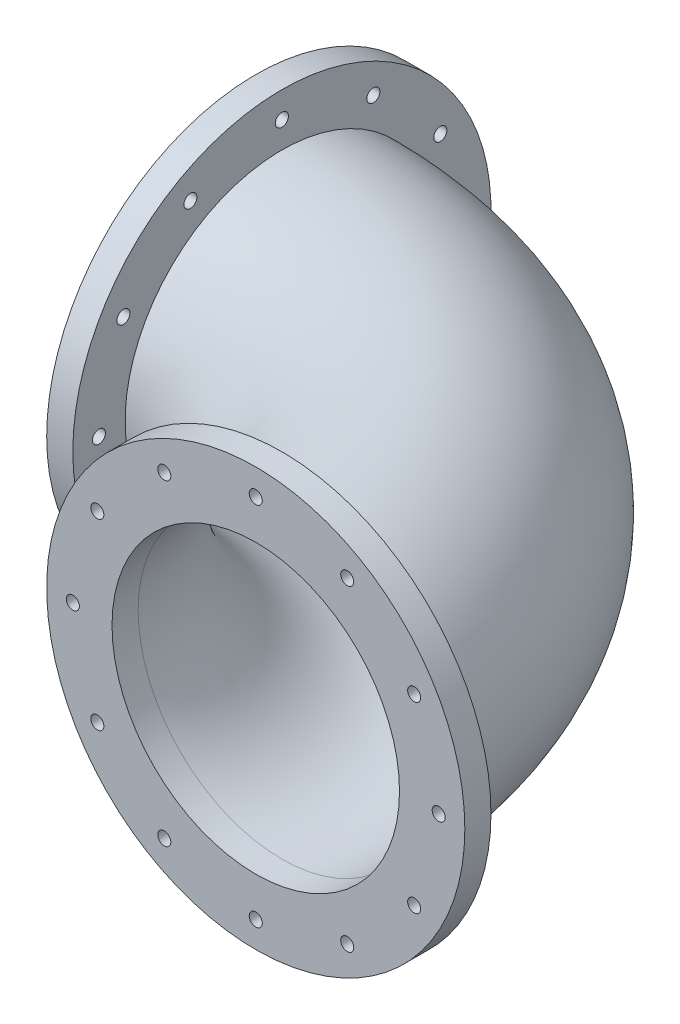
ISO-10303-21;
HEADER;
FILE_DESCRIPTION(('STEP AP214'),'2;1');
FILE_NAME('part.step','',(''),(''),'','','');
FILE_SCHEMA(('AUTOMOTIVE_DESIGN { 1 0 10303 214 1 1 1 1 }'));
ENDSEC;
DATA;
#1=APPLICATION_CONTEXT('core data for automotive mechanical design processes');
#2=APPLICATION_PROTOCOL_DEFINITION('international standard','automotive_design',2000,#1);
#3=PRODUCT_CONTEXT('',#1,'mechanical');
#4=PRODUCT('Part','Part','',(#3));
#5=PRODUCT_RELATED_PRODUCT_CATEGORY('part','',(#4));
#6=PRODUCT_DEFINITION_FORMATION('','',#4);
#7=PRODUCT_DEFINITION_CONTEXT('part definition',#1,'design');
#8=PRODUCT_DEFINITION('design','',#6,#7);
#9=PRODUCT_DEFINITION_SHAPE('','',#8);
#10=(LENGTH_UNIT() NAMED_UNIT(*) SI_UNIT(.MILLI.,.METRE.));
#11=(NAMED_UNIT(*) PLANE_ANGLE_UNIT() SI_UNIT($,.RADIAN.));
#12=(NAMED_UNIT(*) SI_UNIT($,.STERADIAN.) SOLID_ANGLE_UNIT());
#13=UNCERTAINTY_MEASURE_WITH_UNIT(LENGTH_MEASURE(1.E-05),#10,'distance_accuracy_value','');
#14=(GEOMETRIC_REPRESENTATION_CONTEXT(3) GLOBAL_UNCERTAINTY_ASSIGNED_CONTEXT((#13)) GLOBAL_UNIT_ASSIGNED_CONTEXT((#10,
#11,#12)) REPRESENTATION_CONTEXT('',''));
#15=CARTESIAN_POINT('',(0.,0.,0.));
#16=DIRECTION('',(0.,0.,1.));
#17=DIRECTION('',(1.,0.,0.));
#18=AXIS2_PLACEMENT_3D('',#15,#16,#17);
#19=CARTESIAN_POINT('',(0.,0.,0.));
#20=DIRECTION('',(0.,-1.,0.));
#21=DIRECTION('',(0.,0.,-1.));
#22=AXIS2_PLACEMENT_3D('',#19,#20,#21);
#23=TOROIDAL_SURFACE('',#22,152.4,76.2);
#24=CARTESIAN_POINT('',(0.,0.,-152.4));
#25=DIRECTION('',(1.,0.,0.));
#26=DIRECTION('',(0.,0.,-1.));
#27=AXIS2_PLACEMENT_3D('',#24,#25,#26);
#28=CIRCLE('',#27,76.2);
#29=CARTESIAN_POINT('',(0.,0.,-228.6));
#30=VERTEX_POINT('',#29);
#31=EDGE_CURVE('E203',#30,#30,#28,.T.);
#32=CARTESIAN_POINT('',(152.4,0.,0.));
#33=DIRECTION('',(0.,0.,1.));
#34=DIRECTION('',(1.,0.,0.));
#35=AXIS2_PLACEMENT_3D('',#32,#33,#34);
#36=CIRCLE('',#35,76.2);
#37=CARTESIAN_POINT('',(228.6,0.,0.));
#38=VERTEX_POINT('',#37);
#39=EDGE_CURVE('E208',#38,#38,#36,.T.);
#40=CARTESIAN_POINT('',(0.,0.,0.));
#41=DIRECTION('',(0.,-1.,0.));
#42=DIRECTION('',(0.,0.,-1.));
#43=AXIS2_PLACEMENT_3D('',#40,#41,#42);
#44=CIRCLE('',#43,228.6);
#45=EDGE_CURVE('',#30,#38,#44,.T.);
#46=ORIENTED_EDGE('',*,*,#31,.T.);
#47=ORIENTED_EDGE('',*,*,#39,.F.);
#48=ORIENTED_EDGE('',*,*,#45,.T.);
#49=ORIENTED_EDGE('',*,*,#45,.F.);
#50=EDGE_LOOP('',(#46,#48,#47,#49));
#51=FACE_BOUND('',#50,.T.);
#52=ADVANCED_FACE('F200',(#51),#23,.T.);
#53=CARTESIAN_POINT('',(0.,0.,0.));
#54=DIRECTION('',(0.,-1.,0.));
#55=DIRECTION('',(0.,0.,-1.));
#56=AXIS2_PLACEMENT_3D('',#53,#54,#55);
#57=TOROIDAL_SURFACE('',#56,152.4,69.85);
#58=CARTESIAN_POINT('',(0.,0.,-152.4));
#59=DIRECTION('',(-1.,0.,0.));
#60=DIRECTION('',(0.,0.,1.));
#61=AXIS2_PLACEMENT_3D('',#58,#59,#60);
#62=CIRCLE('',#61,69.85);
#63=CARTESIAN_POINT('',(0.,0.,-222.25));
#64=VERTEX_POINT('',#63);
#65=EDGE_CURVE('E225',#64,#64,#62,.T.);
#66=CARTESIAN_POINT('',(152.4,0.,0.));
#67=DIRECTION('',(0.,0.,1.));
#68=DIRECTION('',(1.,0.,0.));
#69=AXIS2_PLACEMENT_3D('',#66,#67,#68);
#70=CIRCLE('',#69,69.85);
#71=CARTESIAN_POINT('',(222.25,0.,0.));
#72=VERTEX_POINT('',#71);
#73=EDGE_CURVE('E11',#72,#72,#70,.F.);
#74=CARTESIAN_POINT('',(0.,0.,0.));
#75=DIRECTION('',(0.,-1.,0.));
#76=DIRECTION('',(0.,0.,-1.));
#77=AXIS2_PLACEMENT_3D('',#74,#75,#76);
#78=CIRCLE('',#77,222.25);
#79=EDGE_CURVE('',#64,#72,#78,.T.);
#80=ORIENTED_EDGE('',*,*,#65,.T.);
#81=ORIENTED_EDGE('',*,*,#73,.F.);
#82=ORIENTED_EDGE('',*,*,#79,.T.);
#83=ORIENTED_EDGE('',*,*,#79,.F.);
#84=EDGE_LOOP('',(#80,#82,#81,#83));
#85=FACE_BOUND('',#84,.T.);
#86=ADVANCED_FACE('F460',(#85),#57,.F.);
#87=CARTESIAN_POINT('',(-12.7,0.,-152.4));
#88=DIRECTION('',(-1.,0.,0.));
#89=DIRECTION('',(0.,0.,1.));
#90=AXIS2_PLACEMENT_3D('',#87,#88,#89);
#91=PLANE('',#90);
#92=CARTESIAN_POINT('',(-12.7,0.,-241.3));
#93=DIRECTION('',(-1.,0.,0.));
#94=DIRECTION('',(0.,0.,1.));
#95=AXIS2_PLACEMENT_3D('',#92,#93,#94);
#96=CIRCLE('',#95,3.175);
#97=CARTESIAN_POINT('',(-12.7,0.,-238.125));
#98=VERTEX_POINT('',#97);
#99=EDGE_CURVE('E309',#98,#98,#96,.T.);
#100=ORIENTED_EDGE('',*,*,#99,.F.);
#101=EDGE_LOOP('',(#100));
#102=FACE_BOUND('',#101,.T.);
#103=CARTESIAN_POINT('',(-12.7,76.9896583964361,-196.850000000001));
#104=DIRECTION('',(-1.,0.,0.));
#105=DIRECTION('',(0.,0.,1.));
#106=AXIS2_PLACEMENT_3D('',#103,#104,#105);
#107=CIRCLE('',#106,3.17500000000001);
#108=CARTESIAN_POINT('',(-12.7,76.9896583964361,-193.675000000001));
#109=VERTEX_POINT('',#108);
#110=EDGE_CURVE('E293',#109,#109,#107,.T.);
#111=ORIENTED_EDGE('',*,*,#110,.F.);
#112=EDGE_LOOP('',(#111));
#113=FACE_BOUND('',#112,.T.);
#114=CARTESIAN_POINT('',(-12.7,76.989658396437,-107.950000000001));
#115=DIRECTION('',(-1.,0.,0.));
#116=DIRECTION('',(0.,0.,1.));
#117=AXIS2_PLACEMENT_3D('',#114,#115,#116);
#118=CIRCLE('',#117,3.175);
#119=CARTESIAN_POINT('',(-12.7,76.989658396437,-104.775000000001));
#120=VERTEX_POINT('',#119);
#121=EDGE_CURVE('E277',#120,#120,#118,.T.);
#122=ORIENTED_EDGE('',*,*,#121,.F.);
#123=EDGE_LOOP('',(#122));
#124=FACE_BOUND('',#123,.T.);
#125=CARTESIAN_POINT('',(-12.7,6.20785382046309E-13,-63.5));
#126=DIRECTION('',(-1.,0.,0.));
#127=DIRECTION('',(0.,0.,1.));
#128=AXIS2_PLACEMENT_3D('',#125,#126,#127);
#129=CIRCLE('',#128,3.17500000000001);
#130=CARTESIAN_POINT('',(-12.7,6.20785382046309E-13,-60.325));
#131=VERTEX_POINT('',#130);
#132=EDGE_CURVE('E261',#131,#131,#129,.T.);
#133=ORIENTED_EDGE('',*,*,#132,.F.);
#134=EDGE_LOOP('',(#133));
#135=FACE_BOUND('',#134,.T.);
#136=CARTESIAN_POINT('',(-12.7,-76.9896583964364,-107.95));
#137=DIRECTION('',(-1.,0.,0.));
#138=DIRECTION('',(0.,0.,1.));
#139=AXIS2_PLACEMENT_3D('',#136,#137,#138);
#140=CIRCLE('',#139,3.17499999999998);
#141=CARTESIAN_POINT('',(-12.7,-76.9896583964364,-104.775));
#142=VERTEX_POINT('',#141);
#143=EDGE_CURVE('E245',#142,#142,#140,.T.);
#144=ORIENTED_EDGE('',*,*,#143,.F.);
#145=EDGE_LOOP('',(#144));
#146=FACE_BOUND('',#145,.T.);
#147=CARTESIAN_POINT('',(-12.7,-76.9896583964367,-196.85));
#148=DIRECTION('',(-1.,0.,0.));
#149=DIRECTION('',(0.,0.,1.));
#150=AXIS2_PLACEMENT_3D('',#147,#148,#149);
#151=CIRCLE('',#150,3.175);
#152=CARTESIAN_POINT('',(-12.7,-76.9896583964367,-193.675));
#153=VERTEX_POINT('',#152);
#154=EDGE_CURVE('E229',#153,#153,#151,.T.);
#155=ORIENTED_EDGE('',*,*,#154,.F.);
#156=EDGE_LOOP('',(#155));
#157=FACE_BOUND('',#156,.T.);
#158=CARTESIAN_POINT('',(-12.7,0.,-152.4));
#159=DIRECTION('',(-1.,0.,0.));
#160=DIRECTION('',(0.,0.,1.));
#161=AXIS2_PLACEMENT_3D('',#158,#159,#160);
#162=CIRCLE('',#161,101.6);
#163=CARTESIAN_POINT('',(-12.7,0.,-50.8));
#164=VERTEX_POINT('',#163);
#165=EDGE_CURVE('E220',#164,#164,#162,.T.);
#166=ORIENTED_EDGE('',*,*,#165,.T.);
#167=EDGE_LOOP('',(#166));
#168=FACE_BOUND('',#167,.T.);
#169=CARTESIAN_POINT('',(-12.7,0.,-152.4));
#170=DIRECTION('',(-1.,0.,0.));
#171=DIRECTION('',(0.,0.,1.));
#172=AXIS2_PLACEMENT_3D('',#169,#170,#171);
#173=CIRCLE('',#172,69.85);
#174=CARTESIAN_POINT('',(-12.7,0.,-82.55));
#175=VERTEX_POINT('',#174);
#176=EDGE_CURVE('E221',#175,#175,#173,.T.);
#177=ORIENTED_EDGE('',*,*,#176,.F.);
#178=EDGE_LOOP('',(#177));
#179=FACE_BOUND('',#178,.T.);
#180=CARTESIAN_POINT('',(-12.7,-88.9,-152.4));
#181=DIRECTION('',(-1.,0.,0.));
#182=DIRECTION('',(0.,0.,1.));
#183=AXIS2_PLACEMENT_3D('',#180,#181,#182);
#184=CIRCLE('',#183,3.175);
#185=CARTESIAN_POINT('',(-12.7,-88.9,-149.225));
#186=VERTEX_POINT('',#185);
#187=EDGE_CURVE('E237',#186,#186,#184,.T.);
#188=ORIENTED_EDGE('',*,*,#187,.F.);
#189=EDGE_LOOP('',(#188));
#190=FACE_BOUND('',#189,.T.);
#191=CARTESIAN_POINT('',(-12.7,-44.4499999999995,-75.4103416035631));
#192=DIRECTION('',(-1.,0.,0.));
#193=DIRECTION('',(0.,0.,1.));
#194=AXIS2_PLACEMENT_3D('',#191,#192,#193);
#195=CIRCLE('',#194,3.175);
#196=CARTESIAN_POINT('',(-12.7,-44.4499999999995,-72.2353416035631));
#197=VERTEX_POINT('',#196);
#198=EDGE_CURVE('E253',#197,#197,#195,.T.);
#199=ORIENTED_EDGE('',*,*,#198,.F.);
#200=EDGE_LOOP('',(#199));
#201=FACE_BOUND('',#200,.T.);
#202=CARTESIAN_POINT('',(-12.7,44.4500000000007,-75.4103416035638));
#203=DIRECTION('',(-1.,0.,0.));
#204=DIRECTION('',(0.,0.,1.));
#205=AXIS2_PLACEMENT_3D('',#202,#203,#204);
#206=CIRCLE('',#205,3.17500000000002);
#207=CARTESIAN_POINT('',(-12.7,44.4500000000007,-72.2353416035638));
#208=VERTEX_POINT('',#207);
#209=EDGE_CURVE('E269',#208,#208,#206,.T.);
#210=ORIENTED_EDGE('',*,*,#209,.F.);
#211=EDGE_LOOP('',(#210));
#212=FACE_BOUND('',#211,.T.);
#213=CARTESIAN_POINT('',(-12.7,88.9,-152.400000000001));
#214=DIRECTION('',(-1.,0.,0.));
#215=DIRECTION('',(0.,0.,1.));
#216=AXIS2_PLACEMENT_3D('',#213,#214,#215);
#217=CIRCLE('',#216,3.17500000000001);
#218=CARTESIAN_POINT('',(-12.7,88.9,-149.225000000001));
#219=VERTEX_POINT('',#218);
#220=EDGE_CURVE('E285',#219,#219,#217,.T.);
#221=ORIENTED_EDGE('',*,*,#220,.F.);
#222=EDGE_LOOP('',(#221));
#223=FACE_BOUND('',#222,.T.);
#224=CARTESIAN_POINT('',(-12.7,44.449999999999,-229.389658396437));
#225=DIRECTION('',(-1.,0.,0.));
#226=DIRECTION('',(0.,0.,1.));
#227=AXIS2_PLACEMENT_3D('',#224,#225,#226);
#228=CIRCLE('',#227,3.17500000000002);
#229=CARTESIAN_POINT('',(-12.7,44.449999999999,-226.214658396437));
#230=VERTEX_POINT('',#229);
#231=EDGE_CURVE('E301',#230,#230,#228,.T.);
#232=ORIENTED_EDGE('',*,*,#231,.F.);
#233=EDGE_LOOP('',(#232));
#234=FACE_BOUND('',#233,.T.);
#235=CARTESIAN_POINT('',(-12.7,-44.4500000000001,-229.389658396437));
#236=DIRECTION('',(-1.,0.,0.));
#237=DIRECTION('',(0.,0.,1.));
#238=AXIS2_PLACEMENT_3D('',#235,#236,#237);
#239=CIRCLE('',#238,3.175);
#240=CARTESIAN_POINT('',(-12.7,-44.4500000000001,-226.214658396437));
#241=VERTEX_POINT('',#240);
#242=EDGE_CURVE('E317',#241,#241,#239,.T.);
#243=ORIENTED_EDGE('',*,*,#242,.F.);
#244=EDGE_LOOP('',(#243));
#245=FACE_BOUND('',#244,.T.);
#246=ADVANCED_FACE('F462',(#102,#113,#124,#135,#146,#157,#168,#179,#190,#201,#212,#223,#234,
#245),#91,.T.);
#247=CARTESIAN_POINT('',(0.,0.,-152.4));
#248=DIRECTION('',(-1.,0.,0.));
#249=DIRECTION('',(0.,0.,1.));
#250=AXIS2_PLACEMENT_3D('',#247,#248,#249);
#251=PLANE('',#250);
#252=ORIENTED_EDGE('',*,*,#31,.F.);
#253=EDGE_LOOP('',(#252));
#254=FACE_BOUND('',#253,.T.);
#255=CARTESIAN_POINT('',(0.,0.,-152.4));
#256=DIRECTION('',(-1.,0.,0.));
#257=DIRECTION('',(0.,0.,1.));
#258=AXIS2_PLACEMENT_3D('',#255,#256,#257);
#259=CIRCLE('',#258,101.6);
#260=CARTESIAN_POINT('',(0.,0.,-50.8));
#261=VERTEX_POINT('',#260);
#262=EDGE_CURVE('E216',#261,#261,#259,.T.);
#263=ORIENTED_EDGE('',*,*,#262,.F.);
#264=EDGE_LOOP('',(#263));
#265=FACE_BOUND('',#264,.T.);
#266=CARTESIAN_POINT('',(0.,-76.9896583964367,-196.85));
#267=DIRECTION('',(-1.,0.,0.));
#268=DIRECTION('',(0.,0.,1.));
#269=AXIS2_PLACEMENT_3D('',#266,#267,#268);
#270=CIRCLE('',#269,3.175);
#271=CARTESIAN_POINT('',(0.,-76.9896583964367,-193.675));
#272=VERTEX_POINT('',#271);
#273=EDGE_CURVE('E233',#272,#272,#270,.T.);
#274=ORIENTED_EDGE('',*,*,#273,.T.);
#275=EDGE_LOOP('',(#274));
#276=FACE_BOUND('',#275,.T.);
#277=CARTESIAN_POINT('',(0.,-88.9,-152.4));
#278=DIRECTION('',(-1.,0.,0.));
#279=DIRECTION('',(0.,0.,1.));
#280=AXIS2_PLACEMENT_3D('',#277,#278,#279);
#281=CIRCLE('',#280,3.175);
#282=CARTESIAN_POINT('',(0.,-88.9,-149.225));
#283=VERTEX_POINT('',#282);
#284=EDGE_CURVE('E241',#283,#283,#281,.T.);
#285=ORIENTED_EDGE('',*,*,#284,.T.);
#286=EDGE_LOOP('',(#285));
#287=FACE_BOUND('',#286,.T.);
#288=CARTESIAN_POINT('',(0.,-76.9896583964364,-107.95));
#289=DIRECTION('',(-1.,0.,0.));
#290=DIRECTION('',(0.,0.,1.));
#291=AXIS2_PLACEMENT_3D('',#288,#289,#290);
#292=CIRCLE('',#291,3.17499999999998);
#293=CARTESIAN_POINT('',(0.,-76.9896583964364,-104.775));
#294=VERTEX_POINT('',#293);
#295=EDGE_CURVE('E249',#294,#294,#292,.T.);
#296=ORIENTED_EDGE('',*,*,#295,.T.);
#297=EDGE_LOOP('',(#296));
#298=FACE_BOUND('',#297,.T.);
#299=CARTESIAN_POINT('',(0.,-44.4499999999995,-75.4103416035631));
#300=DIRECTION('',(-1.,0.,0.));
#301=DIRECTION('',(0.,0.,1.));
#302=AXIS2_PLACEMENT_3D('',#299,#300,#301);
#303=CIRCLE('',#302,3.175);
#304=CARTESIAN_POINT('',(0.,-44.4499999999995,-72.2353416035631));
#305=VERTEX_POINT('',#304);
#306=EDGE_CURVE('E257',#305,#305,#303,.T.);
#307=ORIENTED_EDGE('',*,*,#306,.T.);
#308=EDGE_LOOP('',(#307));
#309=FACE_BOUND('',#308,.T.);
#310=CARTESIAN_POINT('',(0.,6.20785382046309E-13,-63.5));
#311=DIRECTION('',(-1.,0.,0.));
#312=DIRECTION('',(0.,0.,1.));
#313=AXIS2_PLACEMENT_3D('',#310,#311,#312);
#314=CIRCLE('',#313,3.17500000000001);
#315=CARTESIAN_POINT('',(0.,6.20785382046309E-13,-60.325));
#316=VERTEX_POINT('',#315);
#317=EDGE_CURVE('E265',#316,#316,#314,.T.);
#318=ORIENTED_EDGE('',*,*,#317,.T.);
#319=EDGE_LOOP('',(#318));
#320=FACE_BOUND('',#319,.T.);
#321=CARTESIAN_POINT('',(0.,44.4500000000007,-75.4103416035638));
#322=DIRECTION('',(-1.,0.,0.));
#323=DIRECTION('',(0.,0.,1.));
#324=AXIS2_PLACEMENT_3D('',#321,#322,#323);
#325=CIRCLE('',#324,3.17500000000002);
#326=CARTESIAN_POINT('',(0.,44.4500000000007,-72.2353416035638));
#327=VERTEX_POINT('',#326);
#328=EDGE_CURVE('E273',#327,#327,#325,.T.);
#329=ORIENTED_EDGE('',*,*,#328,.T.);
#330=EDGE_LOOP('',(#329));
#331=FACE_BOUND('',#330,.T.);
#332=CARTESIAN_POINT('',(0.,76.989658396437,-107.950000000001));
#333=DIRECTION('',(-1.,0.,0.));
#334=DIRECTION('',(0.,0.,1.));
#335=AXIS2_PLACEMENT_3D('',#332,#333,#334);
#336=CIRCLE('',#335,3.175);
#337=CARTESIAN_POINT('',(0.,76.989658396437,-104.775000000001));
#338=VERTEX_POINT('',#337);
#339=EDGE_CURVE('E281',#338,#338,#336,.T.);
#340=ORIENTED_EDGE('',*,*,#339,.T.);
#341=EDGE_LOOP('',(#340));
#342=FACE_BOUND('',#341,.T.);
#343=CARTESIAN_POINT('',(0.,88.9,-152.400000000001));
#344=DIRECTION('',(-1.,0.,0.));
#345=DIRECTION('',(0.,0.,1.));
#346=AXIS2_PLACEMENT_3D('',#343,#344,#345);
#347=CIRCLE('',#346,3.17500000000001);
#348=CARTESIAN_POINT('',(0.,88.9,-149.225000000001));
#349=VERTEX_POINT('',#348);
#350=EDGE_CURVE('E289',#349,#349,#347,.T.);
#351=ORIENTED_EDGE('',*,*,#350,.T.);
#352=EDGE_LOOP('',(#351));
#353=FACE_BOUND('',#352,.T.);
#354=CARTESIAN_POINT('',(0.,76.9896583964361,-196.850000000001));
#355=DIRECTION('',(-1.,0.,0.));
#356=DIRECTION('',(0.,0.,1.));
#357=AXIS2_PLACEMENT_3D('',#354,#355,#356);
#358=CIRCLE('',#357,3.17500000000001);
#359=CARTESIAN_POINT('',(0.,76.9896583964361,-193.675000000001));
#360=VERTEX_POINT('',#359);
#361=EDGE_CURVE('E297',#360,#360,#358,.T.);
#362=ORIENTED_EDGE('',*,*,#361,.T.);
#363=EDGE_LOOP('',(#362));
#364=FACE_BOUND('',#363,.T.);
#365=CARTESIAN_POINT('',(0.,44.449999999999,-229.389658396437));
#366=DIRECTION('',(-1.,0.,0.));
#367=DIRECTION('',(0.,0.,1.));
#368=AXIS2_PLACEMENT_3D('',#365,#366,#367);
#369=CIRCLE('',#368,3.17500000000002);
#370=CARTESIAN_POINT('',(0.,44.449999999999,-226.214658396437));
#371=VERTEX_POINT('',#370);
#372=EDGE_CURVE('E305',#371,#371,#369,.T.);
#373=ORIENTED_EDGE('',*,*,#372,.T.);
#374=EDGE_LOOP('',(#373));
#375=FACE_BOUND('',#374,.T.);
#376=CARTESIAN_POINT('',(0.,0.,-241.3));
#377=DIRECTION('',(-1.,0.,0.));
#378=DIRECTION('',(0.,0.,1.));
#379=AXIS2_PLACEMENT_3D('',#376,#377,#378);
#380=CIRCLE('',#379,3.175);
#381=CARTESIAN_POINT('',(0.,0.,-238.125));
#382=VERTEX_POINT('',#381);
#383=EDGE_CURVE('E313',#382,#382,#380,.T.);
#384=ORIENTED_EDGE('',*,*,#383,.T.);
#385=EDGE_LOOP('',(#384));
#386=FACE_BOUND('',#385,.T.);
#387=CARTESIAN_POINT('',(0.,-44.4500000000001,-229.389658396437));
#388=DIRECTION('',(-1.,0.,0.));
#389=DIRECTION('',(0.,0.,1.));
#390=AXIS2_PLACEMENT_3D('',#387,#388,#389);
#391=CIRCLE('',#390,3.175);
#392=CARTESIAN_POINT('',(0.,-44.4500000000001,-226.214658396437));
#393=VERTEX_POINT('',#392);
#394=EDGE_CURVE('E321',#393,#393,#391,.T.);
#395=ORIENTED_EDGE('',*,*,#394,.T.);
#396=EDGE_LOOP('',(#395));
#397=FACE_BOUND('',#396,.T.);
#398=ADVANCED_FACE('F468',(#254,#265,#276,#287,#298,#309,#320,#331,#342,#353,#364,#375,#386,
#397),#251,.F.);
#399=CARTESIAN_POINT('',(-12.7,0.,-152.4));
#400=DIRECTION('',(1.,0.,0.));
#401=DIRECTION('',(0.,0.,-1.));
#402=AXIS2_PLACEMENT_3D('',#399,#400,#401);
#403=CYLINDRICAL_SURFACE('',#402,101.6);
#404=ORIENTED_EDGE('',*,*,#165,.F.);
#405=EDGE_LOOP('',(#404));
#406=FACE_BOUND('',#405,.T.);
#407=ORIENTED_EDGE('',*,*,#262,.T.);
#408=EDGE_LOOP('',(#407));
#409=FACE_BOUND('',#408,.T.);
#410=ADVANCED_FACE('F474',(#406,#409),#403,.T.);
#411=CARTESIAN_POINT('',(-12.7,0.,-152.4));
#412=DIRECTION('',(1.,0.,0.));
#413=DIRECTION('',(0.,0.,-1.));
#414=AXIS2_PLACEMENT_3D('',#411,#412,#413);
#415=CYLINDRICAL_SURFACE('',#414,69.85);
#416=ORIENTED_EDGE('',*,*,#176,.T.);
#417=EDGE_LOOP('',(#416));
#418=FACE_BOUND('',#417,.T.);
#419=ORIENTED_EDGE('',*,*,#65,.F.);
#420=EDGE_LOOP('',(#419));
#421=FACE_BOUND('',#420,.T.);
#422=ADVANCED_FACE('F477',(#418,#421),#415,.F.);
#423=CARTESIAN_POINT('',(-12.7,-76.9896583964367,-196.85));
#424=DIRECTION('',(1.,0.,0.));
#425=DIRECTION('',(0.,0.,-1.));
#426=AXIS2_PLACEMENT_3D('',#423,#424,#425);
#427=CYLINDRICAL_SURFACE('',#426,3.175);
#428=ORIENTED_EDGE('',*,*,#154,.T.);
#429=EDGE_LOOP('',(#428));
#430=FACE_BOUND('',#429,.T.);
#431=ORIENTED_EDGE('',*,*,#273,.F.);
#432=EDGE_LOOP('',(#431));
#433=FACE_BOUND('',#432,.T.);
#434=ADVANCED_FACE('F484',(#430,#433),#427,.F.);
#435=CARTESIAN_POINT('',(-12.7,-88.9,-152.4));
#436=DIRECTION('',(1.,0.,0.));
#437=DIRECTION('',(0.,0.,-1.));
#438=AXIS2_PLACEMENT_3D('',#435,#436,#437);
#439=CYLINDRICAL_SURFACE('',#438,3.175);
#440=ORIENTED_EDGE('',*,*,#187,.T.);
#441=EDGE_LOOP('',(#440));
#442=FACE_BOUND('',#441,.T.);
#443=ORIENTED_EDGE('',*,*,#284,.F.);
#444=EDGE_LOOP('',(#443));
#445=FACE_BOUND('',#444,.T.);
#446=ADVANCED_FACE('F488',(#442,#445),#439,.F.);
#447=CARTESIAN_POINT('',(-12.7,-76.9896583964364,-107.95));
#448=DIRECTION('',(1.,0.,0.));
#449=DIRECTION('',(0.,0.,-1.));
#450=AXIS2_PLACEMENT_3D('',#447,#448,#449);
#451=CYLINDRICAL_SURFACE('',#450,3.17499999999998);
#452=ORIENTED_EDGE('',*,*,#143,.T.);
#453=EDGE_LOOP('',(#452));
#454=FACE_BOUND('',#453,.T.);
#455=ORIENTED_EDGE('',*,*,#295,.F.);
#456=EDGE_LOOP('',(#455));
#457=FACE_BOUND('',#456,.T.);
#458=ADVANCED_FACE('F492',(#454,#457),#451,.F.);
#459=CARTESIAN_POINT('',(-12.7,-44.4499999999995,-75.4103416035631));
#460=DIRECTION('',(1.,0.,0.));
#461=DIRECTION('',(0.,0.,-1.));
#462=AXIS2_PLACEMENT_3D('',#459,#460,#461);
#463=CYLINDRICAL_SURFACE('',#462,3.175);
#464=ORIENTED_EDGE('',*,*,#198,.T.);
#465=EDGE_LOOP('',(#464));
#466=FACE_BOUND('',#465,.T.);
#467=ORIENTED_EDGE('',*,*,#306,.F.);
#468=EDGE_LOOP('',(#467));
#469=FACE_BOUND('',#468,.T.);
#470=ADVANCED_FACE('F496',(#466,#469),#463,.F.);
#471=CARTESIAN_POINT('',(-12.7,6.20785382046309E-13,-63.5));
#472=DIRECTION('',(1.,0.,0.));
#473=DIRECTION('',(0.,0.,-1.));
#474=AXIS2_PLACEMENT_3D('',#471,#472,#473);
#475=CYLINDRICAL_SURFACE('',#474,3.17500000000001);
#476=ORIENTED_EDGE('',*,*,#132,.T.);
#477=EDGE_LOOP('',(#476));
#478=FACE_BOUND('',#477,.T.);
#479=ORIENTED_EDGE('',*,*,#317,.F.);
#480=EDGE_LOOP('',(#479));
#481=FACE_BOUND('',#480,.T.);
#482=ADVANCED_FACE('F500',(#478,#481),#475,.F.);
#483=CARTESIAN_POINT('',(-12.7,44.4500000000007,-75.4103416035638));
#484=DIRECTION('',(1.,0.,0.));
#485=DIRECTION('',(0.,0.,-1.));
#486=AXIS2_PLACEMENT_3D('',#483,#484,#485);
#487=CYLINDRICAL_SURFACE('',#486,3.17500000000002);
#488=ORIENTED_EDGE('',*,*,#209,.T.);
#489=EDGE_LOOP('',(#488));
#490=FACE_BOUND('',#489,.T.);
#491=ORIENTED_EDGE('',*,*,#328,.F.);
#492=EDGE_LOOP('',(#491));
#493=FACE_BOUND('',#492,.T.);
#494=ADVANCED_FACE('F504',(#490,#493),#487,.F.);
#495=CARTESIAN_POINT('',(-12.7,76.989658396437,-107.950000000001));
#496=DIRECTION('',(1.,0.,0.));
#497=DIRECTION('',(0.,0.,-1.));
#498=AXIS2_PLACEMENT_3D('',#495,#496,#497);
#499=CYLINDRICAL_SURFACE('',#498,3.175);
#500=ORIENTED_EDGE('',*,*,#121,.T.);
#501=EDGE_LOOP('',(#500));
#502=FACE_BOUND('',#501,.T.);
#503=ORIENTED_EDGE('',*,*,#339,.F.);
#504=EDGE_LOOP('',(#503));
#505=FACE_BOUND('',#504,.T.);
#506=ADVANCED_FACE('F508',(#502,#505),#499,.F.);
#507=CARTESIAN_POINT('',(-12.7,88.9,-152.400000000001));
#508=DIRECTION('',(1.,0.,0.));
#509=DIRECTION('',(0.,0.,-1.));
#510=AXIS2_PLACEMENT_3D('',#507,#508,#509);
#511=CYLINDRICAL_SURFACE('',#510,3.17500000000001);
#512=ORIENTED_EDGE('',*,*,#220,.T.);
#513=EDGE_LOOP('',(#512));
#514=FACE_BOUND('',#513,.T.);
#515=ORIENTED_EDGE('',*,*,#350,.F.);
#516=EDGE_LOOP('',(#515));
#517=FACE_BOUND('',#516,.T.);
#518=ADVANCED_FACE('F512',(#514,#517),#511,.F.);
#519=CARTESIAN_POINT('',(-12.7,76.9896583964361,-196.850000000001));
#520=DIRECTION('',(1.,0.,0.));
#521=DIRECTION('',(0.,0.,-1.));
#522=AXIS2_PLACEMENT_3D('',#519,#520,#521);
#523=CYLINDRICAL_SURFACE('',#522,3.17500000000001);
#524=ORIENTED_EDGE('',*,*,#110,.T.);
#525=EDGE_LOOP('',(#524));
#526=FACE_BOUND('',#525,.T.);
#527=ORIENTED_EDGE('',*,*,#361,.F.);
#528=EDGE_LOOP('',(#527));
#529=FACE_BOUND('',#528,.T.);
#530=ADVANCED_FACE('F516',(#526,#529),#523,.F.);
#531=CARTESIAN_POINT('',(-12.7,44.449999999999,-229.389658396437));
#532=DIRECTION('',(1.,0.,0.));
#533=DIRECTION('',(0.,0.,-1.));
#534=AXIS2_PLACEMENT_3D('',#531,#532,#533);
#535=CYLINDRICAL_SURFACE('',#534,3.17500000000002);
#536=ORIENTED_EDGE('',*,*,#231,.T.);
#537=EDGE_LOOP('',(#536));
#538=FACE_BOUND('',#537,.T.);
#539=ORIENTED_EDGE('',*,*,#372,.F.);
#540=EDGE_LOOP('',(#539));
#541=FACE_BOUND('',#540,.T.);
#542=ADVANCED_FACE('F520',(#538,#541),#535,.F.);
#543=CARTESIAN_POINT('',(-12.7,0.,-241.3));
#544=DIRECTION('',(1.,0.,0.));
#545=DIRECTION('',(0.,0.,-1.));
#546=AXIS2_PLACEMENT_3D('',#543,#544,#545);
#547=CYLINDRICAL_SURFACE('',#546,3.175);
#548=ORIENTED_EDGE('',*,*,#99,.T.);
#549=EDGE_LOOP('',(#548));
#550=FACE_BOUND('',#549,.T.);
#551=ORIENTED_EDGE('',*,*,#383,.F.);
#552=EDGE_LOOP('',(#551));
#553=FACE_BOUND('',#552,.T.);
#554=ADVANCED_FACE('F454',(#550,#553),#547,.F.);
#555=CARTESIAN_POINT('',(-12.7,-44.4500000000001,-229.389658396437));
#556=DIRECTION('',(1.,0.,0.));
#557=DIRECTION('',(0.,0.,-1.));
#558=AXIS2_PLACEMENT_3D('',#555,#556,#557);
#559=CYLINDRICAL_SURFACE('',#558,3.175);
#560=ORIENTED_EDGE('',*,*,#242,.T.);
#561=EDGE_LOOP('',(#560));
#562=FACE_BOUND('',#561,.T.);
#563=ORIENTED_EDGE('',*,*,#394,.F.);
#564=EDGE_LOOP('',(#563));
#565=FACE_BOUND('',#564,.T.);
#566=ADVANCED_FACE('F444',(#562,#565),#559,.F.);
#567=CARTESIAN_POINT('',(152.4,0.,12.7));
#568=DIRECTION('',(0.,0.,1.));
#569=DIRECTION('',(1.,0.,0.));
#570=AXIS2_PLACEMENT_3D('',#567,#568,#569);
#571=PLANE('',#570);
#572=CARTESIAN_POINT('',(229.389658396442,-44.4499999999971,12.7));
#573=DIRECTION('',(0.,0.,1.));
#574=DIRECTION('',(1.,0.,0.));
#575=AXIS2_PLACEMENT_3D('',#572,#573,#574);
#576=CIRCLE('',#575,3.17499999999998);
#577=CARTESIAN_POINT('',(232.564658396442,-44.4499999999971,12.7));
#578=VERTEX_POINT('',#577);
#579=EDGE_CURVE('E417',#578,#578,#576,.T.);
#580=ORIENTED_EDGE('',*,*,#579,.F.);
#581=EDGE_LOOP('',(#580));
#582=FACE_BOUND('',#581,.T.);
#583=CARTESIAN_POINT('',(196.850000000007,-76.989658396435,12.7));
#584=DIRECTION('',(0.,0.,1.));
#585=DIRECTION('',(1.,0.,0.));
#586=AXIS2_PLACEMENT_3D('',#583,#584,#585);
#587=CIRCLE('',#586,3.17499999999997);
#588=CARTESIAN_POINT('',(200.025000000007,-76.989658396435,12.7));
#589=VERTEX_POINT('',#588);
#590=EDGE_CURVE('E401',#589,#589,#587,.T.);
#591=ORIENTED_EDGE('',*,*,#590,.F.);
#592=EDGE_LOOP('',(#591));
#593=FACE_BOUND('',#592,.T.);
#594=CARTESIAN_POINT('',(75.4103416035687,-44.4500000000026,12.7));
#595=DIRECTION('',(0.,0.,1.));
#596=DIRECTION('',(1.,0.,0.));
#597=AXIS2_PLACEMENT_3D('',#594,#595,#596);
#598=CIRCLE('',#597,3.17499999999997);
#599=CARTESIAN_POINT('',(78.5853416035686,-44.4500000000026,12.7));
#600=VERTEX_POINT('',#599);
#601=EDGE_CURVE('E385',#600,#600,#598,.T.);
#602=ORIENTED_EDGE('',*,*,#601,.F.);
#603=EDGE_LOOP('',(#602));
#604=FACE_BOUND('',#603,.T.);
#605=CARTESIAN_POINT('',(75.4103416035658,44.4499999999976,12.7));
#606=DIRECTION('',(0.,0.,1.));
#607=DIRECTION('',(1.,0.,0.));
#608=AXIS2_PLACEMENT_3D('',#605,#606,#607);
#609=CIRCLE('',#608,3.17500000000001);
#610=CARTESIAN_POINT('',(78.5853416035658,44.4499999999976,12.7));
#611=VERTEX_POINT('',#610);
#612=EDGE_CURVE('E369',#611,#611,#609,.T.);
#613=ORIENTED_EDGE('',*,*,#612,.F.);
#614=EDGE_LOOP('',(#613));
#615=FACE_BOUND('',#614,.T.);
#616=CARTESIAN_POINT('',(152.4,88.9,12.7));
#617=DIRECTION('',(0.,0.,1.));
#618=DIRECTION('',(1.,0.,0.));
#619=AXIS2_PLACEMENT_3D('',#616,#617,#618);
#620=CIRCLE('',#619,3.175);
#621=CARTESIAN_POINT('',(155.575,88.9,12.7));
#622=VERTEX_POINT('',#621);
#623=EDGE_CURVE('E353',#622,#622,#620,.T.);
#624=ORIENTED_EDGE('',*,*,#623,.F.);
#625=EDGE_LOOP('',(#624));
#626=FACE_BOUND('',#625,.T.);
#627=CARTESIAN_POINT('',(229.389658396439,44.4500000000031,12.7));
#628=DIRECTION('',(0.,0.,1.));
#629=DIRECTION('',(1.,0.,0.));
#630=AXIS2_PLACEMENT_3D('',#627,#628,#629);
#631=CIRCLE('',#630,3.17499999999999);
#632=CARTESIAN_POINT('',(232.564658396439,44.4500000000031,12.7));
#633=VERTEX_POINT('',#632);
#634=EDGE_CURVE('E340',#633,#633,#631,.T.);
#635=ORIENTED_EDGE('',*,*,#634,.F.);
#636=EDGE_LOOP('',(#635));
#637=FACE_BOUND('',#636,.T.);
#638=CARTESIAN_POINT('',(152.4,0.,12.7));
#639=DIRECTION('',(0.,0.,1.));
#640=DIRECTION('',(1.,0.,0.));
#641=AXIS2_PLACEMENT_3D('',#638,#639,#640);
#642=CIRCLE('',#641,101.6);
#643=CARTESIAN_POINT('',(254.,0.,12.7));
#644=VERTEX_POINT('',#643);
#645=EDGE_CURVE('E325',#644,#644,#642,.T.);
#646=ORIENTED_EDGE('',*,*,#645,.T.);
#647=EDGE_LOOP('',(#646));
#648=FACE_BOUND('',#647,.T.);
#649=CARTESIAN_POINT('',(152.4,0.,12.7));
#650=DIRECTION('',(0.,0.,1.));
#651=DIRECTION('',(1.,0.,0.));
#652=AXIS2_PLACEMENT_3D('',#649,#650,#651);
#653=CIRCLE('',#652,69.85);
#654=CARTESIAN_POINT('',(222.25,0.,12.7));
#655=VERTEX_POINT('',#654);
#656=EDGE_CURVE('E333',#655,#655,#653,.T.);
#657=ORIENTED_EDGE('',*,*,#656,.F.);
#658=EDGE_LOOP('',(#657));
#659=FACE_BOUND('',#658,.T.);
#660=CARTESIAN_POINT('',(196.850000000001,76.9896583964385,12.7));
#661=DIRECTION('',(0.,0.,1.));
#662=DIRECTION('',(1.,0.,0.));
#663=AXIS2_PLACEMENT_3D('',#660,#661,#662);
#664=CIRCLE('',#663,3.17500000000001);
#665=CARTESIAN_POINT('',(200.025000000001,76.9896583964385,12.7));
#666=VERTEX_POINT('',#665);
#667=EDGE_CURVE('E345',#666,#666,#664,.T.);
#668=ORIENTED_EDGE('',*,*,#667,.F.);
#669=EDGE_LOOP('',(#668));
#670=FACE_BOUND('',#669,.T.);
#671=CARTESIAN_POINT('',(107.950000000001,76.9896583964353,12.7));
#672=DIRECTION('',(0.,0.,1.));
#673=DIRECTION('',(1.,0.,0.));
#674=AXIS2_PLACEMENT_3D('',#671,#672,#673);
#675=CIRCLE('',#674,3.17499999999999);
#676=CARTESIAN_POINT('',(111.125000000001,76.9896583964353,12.7));
#677=VERTEX_POINT('',#676);
#678=EDGE_CURVE('E361',#677,#677,#675,.T.);
#679=ORIENTED_EDGE('',*,*,#678,.F.);
#680=EDGE_LOOP('',(#679));
#681=FACE_BOUND('',#680,.T.);
#682=CARTESIAN_POINT('',(63.5000000000037,-2.80331313717852E-12,12.7));
#683=DIRECTION('',(0.,0.,1.));
#684=DIRECTION('',(1.,0.,0.));
#685=AXIS2_PLACEMENT_3D('',#682,#683,#684);
#686=CIRCLE('',#685,3.17499999999999);
#687=CARTESIAN_POINT('',(66.6750000000037,-2.80331313717852E-12,12.7));
#688=VERTEX_POINT('',#687);
#689=EDGE_CURVE('E377',#688,#688,#686,.T.);
#690=ORIENTED_EDGE('',*,*,#689,.F.);
#691=EDGE_LOOP('',(#690));
#692=FACE_BOUND('',#691,.T.);
#693=CARTESIAN_POINT('',(107.950000000006,-76.9896583964381,12.7));
#694=DIRECTION('',(0.,0.,1.));
#695=DIRECTION('',(1.,0.,0.));
#696=AXIS2_PLACEMENT_3D('',#693,#694,#695);
#697=CIRCLE('',#696,3.17499999999998);
#698=CARTESIAN_POINT('',(111.125000000006,-76.9896583964381,12.7));
#699=VERTEX_POINT('',#698);
#700=EDGE_CURVE('E393',#699,#699,#697,.T.);
#701=ORIENTED_EDGE('',*,*,#700,.F.);
#702=EDGE_LOOP('',(#701));
#703=FACE_BOUND('',#702,.T.);
#704=CARTESIAN_POINT('',(152.400000000007,-88.9,12.7));
#705=DIRECTION('',(0.,0.,1.));
#706=DIRECTION('',(1.,0.,0.));
#707=AXIS2_PLACEMENT_3D('',#704,#705,#706);
#708=CIRCLE('',#707,3.17500000000002);
#709=CARTESIAN_POINT('',(155.575000000007,-88.9,12.7));
#710=VERTEX_POINT('',#709);
#711=EDGE_CURVE('E409',#710,#710,#708,.T.);
#712=ORIENTED_EDGE('',*,*,#711,.F.);
#713=EDGE_LOOP('',(#712));
#714=FACE_BOUND('',#713,.T.);
#715=CARTESIAN_POINT('',(241.300000000004,3.46944695195361E-12,12.7));
#716=DIRECTION('',(0.,0.,1.));
#717=DIRECTION('',(1.,0.,0.));
#718=AXIS2_PLACEMENT_3D('',#715,#716,#717);
#719=CIRCLE('',#718,3.175);
#720=CARTESIAN_POINT('',(244.475000000004,3.46944695195361E-12,12.7));
#721=VERTEX_POINT('',#720);
#722=EDGE_CURVE('E425',#721,#721,#719,.T.);
#723=ORIENTED_EDGE('',*,*,#722,.F.);
#724=EDGE_LOOP('',(#723));
#725=FACE_BOUND('',#724,.T.);
#726=ADVANCED_FACE('F441',(#582,#593,#604,#615,#626,#637,#648,#659,#670,#681,#692,#703,#714,
#725),#571,.T.);
#727=CARTESIAN_POINT('',(152.4,0.,0.));
#728=DIRECTION('',(0.,0.,1.));
#729=DIRECTION('',(1.,0.,0.));
#730=AXIS2_PLACEMENT_3D('',#727,#728,#729);
#731=PLANE('',#730);
#732=ORIENTED_EDGE('',*,*,#39,.T.);
#733=EDGE_LOOP('',(#732));
#734=FACE_BOUND('',#733,.T.);
#735=CARTESIAN_POINT('',(152.4,0.,0.));
#736=DIRECTION('',(0.,0.,1.));
#737=DIRECTION('',(1.,0.,0.));
#738=AXIS2_PLACEMENT_3D('',#735,#736,#737);
#739=CIRCLE('',#738,101.6);
#740=CARTESIAN_POINT('',(254.,0.,0.));
#741=VERTEX_POINT('',#740);
#742=EDGE_CURVE('E329',#741,#741,#739,.T.);
#743=ORIENTED_EDGE('',*,*,#742,.F.);
#744=EDGE_LOOP('',(#743));
#745=FACE_BOUND('',#744,.T.);
#746=CARTESIAN_POINT('',(229.389658396439,44.4500000000031,0.));
#747=DIRECTION('',(0.,0.,1.));
#748=DIRECTION('',(1.,0.,0.));
#749=AXIS2_PLACEMENT_3D('',#746,#747,#748);
#750=CIRCLE('',#749,3.17499999999999);
#751=CARTESIAN_POINT('',(232.564658396439,44.4500000000031,0.));
#752=VERTEX_POINT('',#751);
#753=EDGE_CURVE('E341',#752,#752,#750,.T.);
#754=ORIENTED_EDGE('',*,*,#753,.T.);
#755=EDGE_LOOP('',(#754));
#756=FACE_BOUND('',#755,.T.);
#757=CARTESIAN_POINT('',(196.850000000001,76.9896583964385,0.));
#758=DIRECTION('',(0.,0.,1.));
#759=DIRECTION('',(1.,0.,0.));
#760=AXIS2_PLACEMENT_3D('',#757,#758,#759);
#761=CIRCLE('',#760,3.17500000000001);
#762=CARTESIAN_POINT('',(200.025000000001,76.9896583964385,0.));
#763=VERTEX_POINT('',#762);
#764=EDGE_CURVE('E349',#763,#763,#761,.T.);
#765=ORIENTED_EDGE('',*,*,#764,.T.);
#766=EDGE_LOOP('',(#765));
#767=FACE_BOUND('',#766,.T.);
#768=CARTESIAN_POINT('',(152.4,88.9,0.));
#769=DIRECTION('',(0.,0.,1.));
#770=DIRECTION('',(1.,0.,0.));
#771=AXIS2_PLACEMENT_3D('',#768,#769,#770);
#772=CIRCLE('',#771,3.175);
#773=CARTESIAN_POINT('',(155.575,88.9,0.));
#774=VERTEX_POINT('',#773);
#775=EDGE_CURVE('E357',#774,#774,#772,.T.);
#776=ORIENTED_EDGE('',*,*,#775,.T.);
#777=EDGE_LOOP('',(#776));
#778=FACE_BOUND('',#777,.T.);
#779=CARTESIAN_POINT('',(107.950000000001,76.9896583964353,0.));
#780=DIRECTION('',(0.,0.,1.));
#781=DIRECTION('',(1.,0.,0.));
#782=AXIS2_PLACEMENT_3D('',#779,#780,#781);
#783=CIRCLE('',#782,3.17499999999999);
#784=CARTESIAN_POINT('',(111.125000000001,76.9896583964353,0.));
#785=VERTEX_POINT('',#784);
#786=EDGE_CURVE('E365',#785,#785,#783,.T.);
#787=ORIENTED_EDGE('',*,*,#786,.T.);
#788=EDGE_LOOP('',(#787));
#789=FACE_BOUND('',#788,.T.);
#790=CARTESIAN_POINT('',(75.4103416035658,44.4499999999976,0.));
#791=DIRECTION('',(0.,0.,1.));
#792=DIRECTION('',(1.,0.,0.));
#793=AXIS2_PLACEMENT_3D('',#790,#791,#792);
#794=CIRCLE('',#793,3.17500000000001);
#795=CARTESIAN_POINT('',(78.5853416035658,44.4499999999976,0.));
#796=VERTEX_POINT('',#795);
#797=EDGE_CURVE('E373',#796,#796,#794,.T.);
#798=ORIENTED_EDGE('',*,*,#797,.T.);
#799=EDGE_LOOP('',(#798));
#800=FACE_BOUND('',#799,.T.);
#801=CARTESIAN_POINT('',(63.5000000000037,-2.80331313717852E-12,0.));
#802=DIRECTION('',(0.,0.,1.));
#803=DIRECTION('',(1.,0.,0.));
#804=AXIS2_PLACEMENT_3D('',#801,#802,#803);
#805=CIRCLE('',#804,3.17499999999999);
#806=CARTESIAN_POINT('',(66.6750000000037,-2.80331313717852E-12,0.));
#807=VERTEX_POINT('',#806);
#808=EDGE_CURVE('E381',#807,#807,#805,.T.);
#809=ORIENTED_EDGE('',*,*,#808,.T.);
#810=EDGE_LOOP('',(#809));
#811=FACE_BOUND('',#810,.T.);
#812=CARTESIAN_POINT('',(75.4103416035687,-44.4500000000026,0.));
#813=DIRECTION('',(0.,0.,1.));
#814=DIRECTION('',(1.,0.,0.));
#815=AXIS2_PLACEMENT_3D('',#812,#813,#814);
#816=CIRCLE('',#815,3.17499999999997);
#817=CARTESIAN_POINT('',(78.5853416035686,-44.4500000000026,0.));
#818=VERTEX_POINT('',#817);
#819=EDGE_CURVE('E389',#818,#818,#816,.T.);
#820=ORIENTED_EDGE('',*,*,#819,.T.);
#821=EDGE_LOOP('',(#820));
#822=FACE_BOUND('',#821,.T.);
#823=CARTESIAN_POINT('',(107.950000000006,-76.9896583964381,0.));
#824=DIRECTION('',(0.,0.,1.));
#825=DIRECTION('',(1.,0.,0.));
#826=AXIS2_PLACEMENT_3D('',#823,#824,#825);
#827=CIRCLE('',#826,3.17499999999998);
#828=CARTESIAN_POINT('',(111.125000000006,-76.9896583964381,0.));
#829=VERTEX_POINT('',#828);
#830=EDGE_CURVE('E397',#829,#829,#827,.T.);
#831=ORIENTED_EDGE('',*,*,#830,.T.);
#832=EDGE_LOOP('',(#831));
#833=FACE_BOUND('',#832,.T.);
#834=CARTESIAN_POINT('',(196.850000000007,-76.989658396435,0.));
#835=DIRECTION('',(0.,0.,1.));
#836=DIRECTION('',(1.,0.,0.));
#837=AXIS2_PLACEMENT_3D('',#834,#835,#836);
#838=CIRCLE('',#837,3.17499999999997);
#839=CARTESIAN_POINT('',(200.025000000007,-76.989658396435,0.));
#840=VERTEX_POINT('',#839);
#841=EDGE_CURVE('E405',#840,#840,#838,.T.);
#842=ORIENTED_EDGE('',*,*,#841,.T.);
#843=EDGE_LOOP('',(#842));
#844=FACE_BOUND('',#843,.T.);
#845=CARTESIAN_POINT('',(152.400000000007,-88.9,0.));
#846=DIRECTION('',(0.,0.,1.));
#847=DIRECTION('',(1.,0.,0.));
#848=AXIS2_PLACEMENT_3D('',#845,#846,#847);
#849=CIRCLE('',#848,3.17500000000002);
#850=CARTESIAN_POINT('',(155.575000000007,-88.9,0.));
#851=VERTEX_POINT('',#850);
#852=EDGE_CURVE('E413',#851,#851,#849,.T.);
#853=ORIENTED_EDGE('',*,*,#852,.T.);
#854=EDGE_LOOP('',(#853));
#855=FACE_BOUND('',#854,.T.);
#856=CARTESIAN_POINT('',(229.389658396442,-44.4499999999971,0.));
#857=DIRECTION('',(0.,0.,1.));
#858=DIRECTION('',(1.,0.,0.));
#859=AXIS2_PLACEMENT_3D('',#856,#857,#858);
#860=CIRCLE('',#859,3.17499999999998);
#861=CARTESIAN_POINT('',(232.564658396442,-44.4499999999971,0.));
#862=VERTEX_POINT('',#861);
#863=EDGE_CURVE('E421',#862,#862,#860,.T.);
#864=ORIENTED_EDGE('',*,*,#863,.T.);
#865=EDGE_LOOP('',(#864));
#866=FACE_BOUND('',#865,.T.);
#867=CARTESIAN_POINT('',(241.300000000004,3.46944695195361E-12,0.));
#868=DIRECTION('',(0.,0.,1.));
#869=DIRECTION('',(1.,0.,0.));
#870=AXIS2_PLACEMENT_3D('',#867,#868,#869);
#871=CIRCLE('',#870,3.175);
#872=CARTESIAN_POINT('',(244.475000000004,3.46944695195361E-12,0.));
#873=VERTEX_POINT('',#872);
#874=EDGE_CURVE('E429',#873,#873,#871,.T.);
#875=ORIENTED_EDGE('',*,*,#874,.T.);
#876=EDGE_LOOP('',(#875));
#877=FACE_BOUND('',#876,.T.);
#878=ADVANCED_FACE('F443',(#734,#745,#756,#767,#778,#789,#800,#811,#822,#833,#844,#855,#866,
#877),#731,.F.);
#879=CARTESIAN_POINT('',(152.4,0.,12.7));
#880=DIRECTION('',(0.,0.,-1.));
#881=DIRECTION('',(-1.,0.,0.));
#882=AXIS2_PLACEMENT_3D('',#879,#880,#881);
#883=CYLINDRICAL_SURFACE('',#882,101.6);
#884=ORIENTED_EDGE('',*,*,#645,.F.);
#885=EDGE_LOOP('',(#884));
#886=FACE_BOUND('',#885,.T.);
#887=ORIENTED_EDGE('',*,*,#742,.T.);
#888=EDGE_LOOP('',(#887));
#889=FACE_BOUND('',#888,.T.);
#890=ADVANCED_FACE('F451',(#886,#889),#883,.T.);
#891=CARTESIAN_POINT('',(152.4,0.,12.7));
#892=DIRECTION('',(0.,0.,-1.));
#893=DIRECTION('',(-1.,0.,0.));
#894=AXIS2_PLACEMENT_3D('',#891,#892,#893);
#895=CYLINDRICAL_SURFACE('',#894,69.85);
#896=ORIENTED_EDGE('',*,*,#656,.T.);
#897=EDGE_LOOP('',(#896));
#898=FACE_BOUND('',#897,.T.);
#899=ORIENTED_EDGE('',*,*,#73,.T.);
#900=EDGE_LOOP('',(#899));
#901=FACE_BOUND('',#900,.T.);
#902=ADVANCED_FACE('F529',(#898,#901),#895,.F.);
#903=CARTESIAN_POINT('',(229.389658396439,44.4500000000031,12.7));
#904=DIRECTION('',(0.,0.,-1.));
#905=DIRECTION('',(-1.,0.,0.));
#906=AXIS2_PLACEMENT_3D('',#903,#904,#905);
#907=CYLINDRICAL_SURFACE('',#906,3.17499999999999);
#908=ORIENTED_EDGE('',*,*,#634,.T.);
#909=EDGE_LOOP('',(#908));
#910=FACE_BOUND('',#909,.T.);
#911=ORIENTED_EDGE('',*,*,#753,.F.);
#912=EDGE_LOOP('',(#911));
#913=FACE_BOUND('',#912,.T.);
#914=ADVANCED_FACE('F534',(#910,#913),#907,.F.);
#915=CARTESIAN_POINT('',(196.850000000001,76.9896583964385,12.7));
#916=DIRECTION('',(0.,0.,-1.));
#917=DIRECTION('',(-1.,0.,0.));
#918=AXIS2_PLACEMENT_3D('',#915,#916,#917);
#919=CYLINDRICAL_SURFACE('',#918,3.17500000000001);
#920=ORIENTED_EDGE('',*,*,#667,.T.);
#921=EDGE_LOOP('',(#920));
#922=FACE_BOUND('',#921,.T.);
#923=ORIENTED_EDGE('',*,*,#764,.F.);
#924=EDGE_LOOP('',(#923));
#925=FACE_BOUND('',#924,.T.);
#926=ADVANCED_FACE('F604',(#922,#925),#919,.F.);
#927=CARTESIAN_POINT('',(152.4,88.9,12.7));
#928=DIRECTION('',(0.,0.,-1.));
#929=DIRECTION('',(-1.,0.,0.));
#930=AXIS2_PLACEMENT_3D('',#927,#928,#929);
#931=CYLINDRICAL_SURFACE('',#930,3.175);
#932=ORIENTED_EDGE('',*,*,#623,.T.);
#933=EDGE_LOOP('',(#932));
#934=FACE_BOUND('',#933,.T.);
#935=ORIENTED_EDGE('',*,*,#775,.F.);
#936=EDGE_LOOP('',(#935));
#937=FACE_BOUND('',#936,.T.);
#938=ADVANCED_FACE('F600',(#934,#937),#931,.F.);
#939=CARTESIAN_POINT('',(107.950000000001,76.9896583964353,12.7));
#940=DIRECTION('',(0.,0.,-1.));
#941=DIRECTION('',(-1.,0.,0.));
#942=AXIS2_PLACEMENT_3D('',#939,#940,#941);
#943=CYLINDRICAL_SURFACE('',#942,3.17499999999999);
#944=ORIENTED_EDGE('',*,*,#678,.T.);
#945=EDGE_LOOP('',(#944));
#946=FACE_BOUND('',#945,.T.);
#947=ORIENTED_EDGE('',*,*,#786,.F.);
#948=EDGE_LOOP('',(#947));
#949=FACE_BOUND('',#948,.T.);
#950=ADVANCED_FACE('F596',(#946,#949),#943,.F.);
#951=CARTESIAN_POINT('',(75.4103416035658,44.4499999999976,12.7));
#952=DIRECTION('',(0.,0.,-1.));
#953=DIRECTION('',(-1.,0.,0.));
#954=AXIS2_PLACEMENT_3D('',#951,#952,#953);
#955=CYLINDRICAL_SURFACE('',#954,3.17500000000001);
#956=ORIENTED_EDGE('',*,*,#612,.T.);
#957=EDGE_LOOP('',(#956));
#958=FACE_BOUND('',#957,.T.);
#959=ORIENTED_EDGE('',*,*,#797,.F.);
#960=EDGE_LOOP('',(#959));
#961=FACE_BOUND('',#960,.T.);
#962=ADVANCED_FACE('F592',(#958,#961),#955,.F.);
#963=CARTESIAN_POINT('',(63.5000000000037,-2.80331313717852E-12,12.7));
#964=DIRECTION('',(0.,0.,-1.));
#965=DIRECTION('',(-1.,0.,0.));
#966=AXIS2_PLACEMENT_3D('',#963,#964,#965);
#967=CYLINDRICAL_SURFACE('',#966,3.17499999999999);
#968=ORIENTED_EDGE('',*,*,#689,.T.);
#969=EDGE_LOOP('',(#968));
#970=FACE_BOUND('',#969,.T.);
#971=ORIENTED_EDGE('',*,*,#808,.F.);
#972=EDGE_LOOP('',(#971));
#973=FACE_BOUND('',#972,.T.);
#974=ADVANCED_FACE('F588',(#970,#973),#967,.F.);
#975=CARTESIAN_POINT('',(75.4103416035687,-44.4500000000026,12.7));
#976=DIRECTION('',(0.,0.,-1.));
#977=DIRECTION('',(-1.,0.,0.));
#978=AXIS2_PLACEMENT_3D('',#975,#976,#977);
#979=CYLINDRICAL_SURFACE('',#978,3.17499999999997);
#980=ORIENTED_EDGE('',*,*,#601,.T.);
#981=EDGE_LOOP('',(#980));
#982=FACE_BOUND('',#981,.T.);
#983=ORIENTED_EDGE('',*,*,#819,.F.);
#984=EDGE_LOOP('',(#983));
#985=FACE_BOUND('',#984,.T.);
#986=ADVANCED_FACE('F584',(#982,#985),#979,.F.);
#987=CARTESIAN_POINT('',(107.950000000006,-76.9896583964381,12.7));
#988=DIRECTION('',(0.,0.,-1.));
#989=DIRECTION('',(-1.,0.,0.));
#990=AXIS2_PLACEMENT_3D('',#987,#988,#989);
#991=CYLINDRICAL_SURFACE('',#990,3.17499999999998);
#992=ORIENTED_EDGE('',*,*,#700,.T.);
#993=EDGE_LOOP('',(#992));
#994=FACE_BOUND('',#993,.T.);
#995=ORIENTED_EDGE('',*,*,#830,.F.);
#996=EDGE_LOOP('',(#995));
#997=FACE_BOUND('',#996,.T.);
#998=ADVANCED_FACE('F580',(#994,#997),#991,.F.);
#999=CARTESIAN_POINT('',(196.850000000007,-76.989658396435,12.7));
#1000=DIRECTION('',(0.,0.,-1.));
#1001=DIRECTION('',(-1.,0.,0.));
#1002=AXIS2_PLACEMENT_3D('',#999,#1000,#1001);
#1003=CYLINDRICAL_SURFACE('',#1002,3.17499999999997);
#1004=ORIENTED_EDGE('',*,*,#590,.T.);
#1005=EDGE_LOOP('',(#1004));
#1006=FACE_BOUND('',#1005,.T.);
#1007=ORIENTED_EDGE('',*,*,#841,.F.);
#1008=EDGE_LOOP('',(#1007));
#1009=FACE_BOUND('',#1008,.T.);
#1010=ADVANCED_FACE('F576',(#1006,#1009),#1003,.F.);
#1011=CARTESIAN_POINT('',(152.400000000007,-88.9,12.7));
#1012=DIRECTION('',(0.,0.,-1.));
#1013=DIRECTION('',(-1.,0.,0.));
#1014=AXIS2_PLACEMENT_3D('',#1011,#1012,#1013);
#1015=CYLINDRICAL_SURFACE('',#1014,3.17500000000002);
#1016=ORIENTED_EDGE('',*,*,#711,.T.);
#1017=EDGE_LOOP('',(#1016));
#1018=FACE_BOUND('',#1017,.T.);
#1019=ORIENTED_EDGE('',*,*,#852,.F.);
#1020=EDGE_LOOP('',(#1019));
#1021=FACE_BOUND('',#1020,.T.);
#1022=ADVANCED_FACE('F570',(#1018,#1021),#1015,.F.);
#1023=CARTESIAN_POINT('',(229.389658396442,-44.4499999999971,12.7));
#1024=DIRECTION('',(0.,0.,-1.));
#1025=DIRECTION('',(-1.,0.,0.));
#1026=AXIS2_PLACEMENT_3D('',#1023,#1024,#1025);
#1027=CYLINDRICAL_SURFACE('',#1026,3.17499999999998);
#1028=ORIENTED_EDGE('',*,*,#579,.T.);
#1029=EDGE_LOOP('',(#1028));
#1030=FACE_BOUND('',#1029,.T.);
#1031=ORIENTED_EDGE('',*,*,#863,.F.);
#1032=EDGE_LOOP('',(#1031));
#1033=FACE_BOUND('',#1032,.T.);
#1034=ADVANCED_FACE('F565',(#1030,#1033),#1027,.F.);
#1035=CARTESIAN_POINT('',(241.300000000004,3.46944695195361E-12,12.7));
#1036=DIRECTION('',(0.,0.,-1.));
#1037=DIRECTION('',(-1.,0.,0.));
#1038=AXIS2_PLACEMENT_3D('',#1035,#1036,#1037);
#1039=CYLINDRICAL_SURFACE('',#1038,3.175);
#1040=ORIENTED_EDGE('',*,*,#722,.T.);
#1041=EDGE_LOOP('',(#1040));
#1042=FACE_BOUND('',#1041,.T.);
#1043=ORIENTED_EDGE('',*,*,#874,.F.);
#1044=EDGE_LOOP('',(#1043));
#1045=FACE_BOUND('',#1044,.T.);
#1046=ADVANCED_FACE('F438',(#1042,#1045),#1039,.F.);
#1047=CLOSED_SHELL('',(#52,#86,#246,#398,#410,#422,#434,#446,#458,#470,#482,#494,#506,#518,#530,
#542,#554,#566,#726,#878,#890,#902,#914,#926,#938,#950,#962,#974,#986,#998,#1010,#1022,#1034,#1046));
#1048=MANIFOLD_SOLID_BREP('B2',#1047);
#1049=ADVANCED_BREP_SHAPE_REPRESENTATION('',(#18,#1048),#14);
#1050=SHAPE_DEFINITION_REPRESENTATION(#9,#1049);
ENDSEC;
END-ISO-10303-21;
